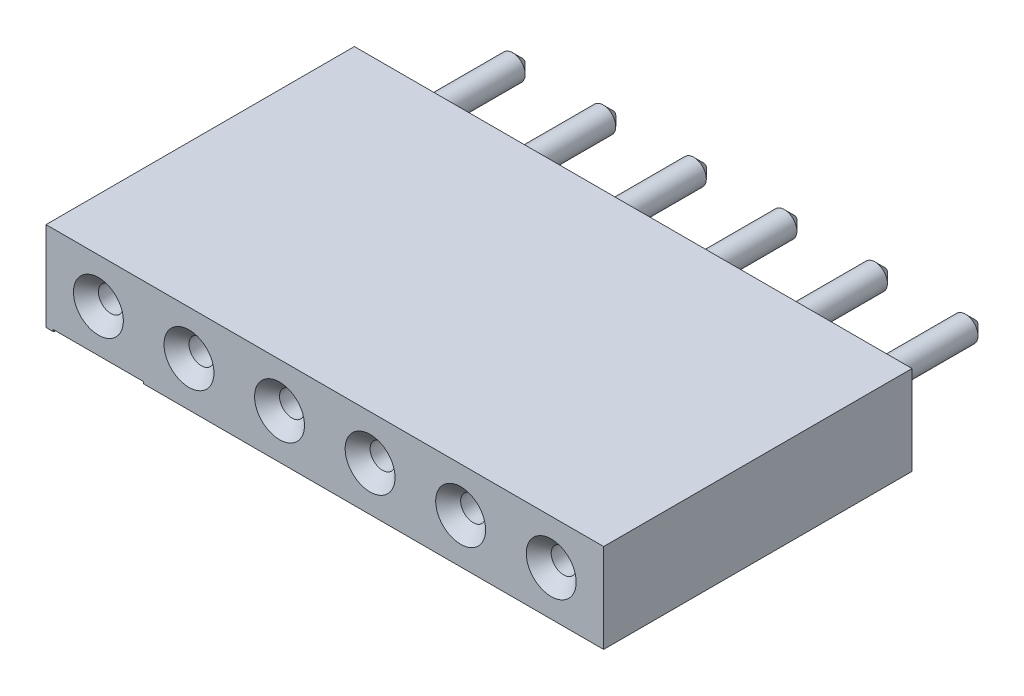
ISO-10303-21;
HEADER;
FILE_DESCRIPTION(('STEP AP214'),'2;1');
FILE_NAME('part.step','',(''),(''),'','','');
FILE_SCHEMA(('AUTOMOTIVE_DESIGN { 1 0 10303 214 1 1 1 1 }'));
ENDSEC;
DATA;
#1=APPLICATION_CONTEXT('core data for automotive mechanical design processes');
#2=APPLICATION_PROTOCOL_DEFINITION('international standard','automotive_design',2000,#1);
#3=PRODUCT_CONTEXT('',#1,'mechanical');
#4=PRODUCT('Part','Part','',(#3));
#5=PRODUCT_RELATED_PRODUCT_CATEGORY('part','',(#4));
#6=PRODUCT_DEFINITION_FORMATION('','',#4);
#7=PRODUCT_DEFINITION_CONTEXT('part definition',#1,'design');
#8=PRODUCT_DEFINITION('design','',#6,#7);
#9=PRODUCT_DEFINITION_SHAPE('','',#8);
#10=(LENGTH_UNIT() NAMED_UNIT(*) SI_UNIT(.MILLI.,.METRE.));
#11=(NAMED_UNIT(*) PLANE_ANGLE_UNIT() SI_UNIT($,.RADIAN.));
#12=(NAMED_UNIT(*) SI_UNIT($,.STERADIAN.) SOLID_ANGLE_UNIT());
#13=UNCERTAINTY_MEASURE_WITH_UNIT(LENGTH_MEASURE(1.E-05),#10,'distance_accuracy_value','');
#14=(GEOMETRIC_REPRESENTATION_CONTEXT(3) GLOBAL_UNCERTAINTY_ASSIGNED_CONTEXT((#13)) GLOBAL_UNIT_ASSIGNED_CONTEXT((#10,
#11,#12)) REPRESENTATION_CONTEXT('',''));
#15=CARTESIAN_POINT('',(0.,0.,0.));
#16=DIRECTION('',(0.,0.,1.));
#17=DIRECTION('',(1.,0.,0.));
#18=AXIS2_PLACEMENT_3D('',#15,#16,#17);
#19=CARTESIAN_POINT('',(12.7,0.,1.73));
#20=DIRECTION('',(0.,0.,1.));
#21=DIRECTION('',(1.,0.,0.));
#22=AXIS2_PLACEMENT_3D('',#19,#20,#21);
#23=PLANE('',#22);
#24=CARTESIAN_POINT('',(12.7,0.,1.73));
#25=DIRECTION('',(0.,0.,1.));
#26=DIRECTION('',(1.,0.,0.));
#27=AXIS2_PLACEMENT_3D('',#24,#25,#26);
#28=CIRCLE('',#27,0.35);
#29=CARTESIAN_POINT('',(13.05,0.,1.73));
#30=VERTEX_POINT('',#29);
#31=EDGE_CURVE('P0_E11',#30,#30,#28,.T.);
#32=ORIENTED_EDGE('',*,*,#31,.T.);
#33=EDGE_LOOP('',(#32));
#34=FACE_BOUND('',#33,.T.);
#35=ADVANCED_FACE('P0_F17',(#34),#23,.T.);
#36=CARTESIAN_POINT('',(10.16,0.,1.73));
#37=DIRECTION('',(0.,0.,1.));
#38=DIRECTION('',(1.,0.,0.));
#39=AXIS2_PLACEMENT_3D('',#36,#37,#38);
#40=PLANE('',#39);
#41=CARTESIAN_POINT('',(10.16,0.,1.73));
#42=DIRECTION('',(0.,0.,1.));
#43=DIRECTION('',(1.,0.,0.));
#44=AXIS2_PLACEMENT_3D('',#41,#42,#43);
#45=CIRCLE('',#44,0.35);
#46=CARTESIAN_POINT('',(10.51,0.,1.73));
#47=VERTEX_POINT('',#46);
#48=EDGE_CURVE('P0_E206',#47,#47,#45,.T.);
#49=ORIENTED_EDGE('',*,*,#48,.T.);
#50=EDGE_LOOP('',(#49));
#51=FACE_BOUND('',#50,.T.);
#52=ADVANCED_FACE('P0_F405',(#51),#40,.T.);
#53=CARTESIAN_POINT('',(5.08,0.,1.73));
#54=DIRECTION('',(0.,0.,1.));
#55=DIRECTION('',(1.,0.,0.));
#56=AXIS2_PLACEMENT_3D('',#53,#54,#55);
#57=PLANE('',#56);
#58=CARTESIAN_POINT('',(5.08,0.,1.73));
#59=DIRECTION('',(0.,0.,1.));
#60=DIRECTION('',(1.,0.,0.));
#61=AXIS2_PLACEMENT_3D('',#58,#59,#60);
#62=CIRCLE('',#61,0.35);
#63=CARTESIAN_POINT('',(5.43,0.,1.73));
#64=VERTEX_POINT('',#63);
#65=EDGE_CURVE('P0_E263',#64,#64,#62,.T.);
#66=ORIENTED_EDGE('',*,*,#65,.T.);
#67=EDGE_LOOP('',(#66));
#68=FACE_BOUND('',#67,.T.);
#69=ADVANCED_FACE('P0_F407',(#68),#57,.T.);
#70=CARTESIAN_POINT('',(7.62,0.,1.73));
#71=DIRECTION('',(0.,0.,1.));
#72=DIRECTION('',(1.,0.,0.));
#73=AXIS2_PLACEMENT_3D('',#70,#71,#72);
#74=PLANE('',#73);
#75=CARTESIAN_POINT('',(7.62,0.,1.73));
#76=DIRECTION('',(0.,0.,1.));
#77=DIRECTION('',(1.,0.,0.));
#78=AXIS2_PLACEMENT_3D('',#75,#76,#77);
#79=CIRCLE('',#78,0.35);
#80=CARTESIAN_POINT('',(7.97,0.,1.73));
#81=VERTEX_POINT('',#80);
#82=EDGE_CURVE('P0_E213',#81,#81,#79,.T.);
#83=ORIENTED_EDGE('',*,*,#82,.T.);
#84=EDGE_LOOP('',(#83));
#85=FACE_BOUND('',#84,.T.);
#86=ADVANCED_FACE('P0_F415',(#85),#74,.T.);
#87=CARTESIAN_POINT('',(2.54,0.,1.73));
#88=DIRECTION('',(0.,0.,1.));
#89=DIRECTION('',(1.,0.,0.));
#90=AXIS2_PLACEMENT_3D('',#87,#88,#89);
#91=PLANE('',#90);
#92=CARTESIAN_POINT('',(2.54,0.,1.73));
#93=DIRECTION('',(0.,0.,1.));
#94=DIRECTION('',(1.,0.,0.));
#95=AXIS2_PLACEMENT_3D('',#92,#93,#94);
#96=CIRCLE('',#95,0.35);
#97=CARTESIAN_POINT('',(2.89,0.,1.73));
#98=VERTEX_POINT('',#97);
#99=EDGE_CURVE('P0_E214',#98,#98,#96,.T.);
#100=ORIENTED_EDGE('',*,*,#99,.T.);
#101=EDGE_LOOP('',(#100));
#102=FACE_BOUND('',#101,.T.);
#103=ADVANCED_FACE('P0_F442',(#102),#91,.T.);
#104=CARTESIAN_POINT('',(0.,0.,1.73));
#105=DIRECTION('',(0.,0.,1.));
#106=DIRECTION('',(1.,0.,0.));
#107=AXIS2_PLACEMENT_3D('',#104,#105,#106);
#108=PLANE('',#107);
#109=CARTESIAN_POINT('',(0.,0.,1.73));
#110=DIRECTION('',(0.,0.,1.));
#111=DIRECTION('',(1.,0.,0.));
#112=AXIS2_PLACEMENT_3D('',#109,#110,#111);
#113=CIRCLE('',#112,0.35);
#114=CARTESIAN_POINT('',(0.35,0.,1.73));
#115=VERTEX_POINT('',#114);
#116=EDGE_CURVE('P0_E240',#115,#115,#113,.T.);
#117=ORIENTED_EDGE('',*,*,#116,.T.);
#118=EDGE_LOOP('',(#117));
#119=FACE_BOUND('',#118,.T.);
#120=ADVANCED_FACE('P0_F427',(#119),#108,.T.);
#121=CARTESIAN_POINT('',(12.7,0.,1.73));
#122=DIRECTION('',(0.,0.,1.));
#123=DIRECTION('',(1.,0.,0.));
#124=AXIS2_PLACEMENT_3D('',#121,#122,#123);
#125=CYLINDRICAL_SURFACE('',#124,0.35);
#126=DIRECTION('',(0.,0.,1.));
#127=VECTOR('',#126,1.);
#128=CARTESIAN_POINT('',(13.05,0.,1.73));
#129=LINE('',#128,#127);
#130=CARTESIAN_POINT('',(13.05,0.,8.3));
#131=VERTEX_POINT('',#130);
#132=EDGE_CURVE('P0_E28',#30,#131,#129,.T.);
#133=ORIENTED_EDGE('',*,*,#132,.F.);
#134=ORIENTED_EDGE('',*,*,#31,.F.);
#135=ORIENTED_EDGE('',*,*,#132,.T.);
#136=CARTESIAN_POINT('',(12.7,0.,8.3));
#137=DIRECTION('',(0.,0.,1.));
#138=DIRECTION('',(1.,0.,0.));
#139=AXIS2_PLACEMENT_3D('',#136,#137,#138);
#140=CIRCLE('',#139,0.35);
#141=EDGE_CURVE('P0_E184',#131,#131,#140,.T.);
#142=ORIENTED_EDGE('',*,*,#141,.T.);
#143=EDGE_LOOP('',(#133,#134,#135,#142));
#144=FACE_BOUND('',#143,.T.);
#145=ADVANCED_FACE('P0_F350',(#144),#125,.F.);
#146=CARTESIAN_POINT('',(10.16,0.,1.73));
#147=DIRECTION('',(0.,0.,1.));
#148=DIRECTION('',(1.,0.,0.));
#149=AXIS2_PLACEMENT_3D('',#146,#147,#148);
#150=CYLINDRICAL_SURFACE('',#149,0.35);
#151=DIRECTION('',(0.,0.,1.));
#152=VECTOR('',#151,1.);
#153=CARTESIAN_POINT('',(10.51,0.,1.73));
#154=LINE('',#153,#152);
#155=CARTESIAN_POINT('',(10.51,0.,8.3));
#156=VERTEX_POINT('',#155);
#157=EDGE_CURVE('P0_E209',#47,#156,#154,.T.);
#158=ORIENTED_EDGE('',*,*,#157,.F.);
#159=ORIENTED_EDGE('',*,*,#48,.F.);
#160=ORIENTED_EDGE('',*,*,#157,.T.);
#161=CARTESIAN_POINT('',(10.16,0.,8.3));
#162=DIRECTION('',(0.,0.,1.));
#163=DIRECTION('',(1.,0.,0.));
#164=AXIS2_PLACEMENT_3D('',#161,#162,#163);
#165=CIRCLE('',#164,0.35);
#166=EDGE_CURVE('P0_E279',#156,#156,#165,.T.);
#167=ORIENTED_EDGE('',*,*,#166,.T.);
#168=EDGE_LOOP('',(#158,#159,#160,#167));
#169=FACE_BOUND('',#168,.T.);
#170=ADVANCED_FACE('P0_F403',(#169),#150,.F.);
#171=CARTESIAN_POINT('',(5.08,0.,1.73));
#172=DIRECTION('',(0.,0.,1.));
#173=DIRECTION('',(1.,0.,0.));
#174=AXIS2_PLACEMENT_3D('',#171,#172,#173);
#175=CYLINDRICAL_SURFACE('',#174,0.35);
#176=DIRECTION('',(0.,0.,1.));
#177=VECTOR('',#176,1.);
#178=CARTESIAN_POINT('',(5.43,0.,1.73));
#179=LINE('',#178,#177);
#180=CARTESIAN_POINT('',(5.43,0.,8.3));
#181=VERTEX_POINT('',#180);
#182=EDGE_CURVE('P0_E260',#64,#181,#179,.T.);
#183=ORIENTED_EDGE('',*,*,#182,.F.);
#184=ORIENTED_EDGE('',*,*,#65,.F.);
#185=ORIENTED_EDGE('',*,*,#182,.T.);
#186=CARTESIAN_POINT('',(5.08,0.,8.3));
#187=DIRECTION('',(0.,0.,1.));
#188=DIRECTION('',(1.,0.,0.));
#189=AXIS2_PLACEMENT_3D('',#186,#187,#188);
#190=CIRCLE('',#189,0.35);
#191=EDGE_CURVE('P0_E328',#181,#181,#190,.T.);
#192=ORIENTED_EDGE('',*,*,#191,.T.);
#193=EDGE_LOOP('',(#183,#184,#185,#192));
#194=FACE_BOUND('',#193,.T.);
#195=ADVANCED_FACE('P0_F420',(#194),#175,.F.);
#196=CARTESIAN_POINT('',(7.62,0.,1.73));
#197=DIRECTION('',(0.,0.,1.));
#198=DIRECTION('',(1.,0.,0.));
#199=AXIS2_PLACEMENT_3D('',#196,#197,#198);
#200=CYLINDRICAL_SURFACE('',#199,0.35);
#201=DIRECTION('',(0.,0.,1.));
#202=VECTOR('',#201,1.);
#203=CARTESIAN_POINT('',(7.97,0.,1.73));
#204=LINE('',#203,#202);
#205=CARTESIAN_POINT('',(7.97,0.,8.3));
#206=VERTEX_POINT('',#205);
#207=EDGE_CURVE('P0_E210',#81,#206,#204,.T.);
#208=ORIENTED_EDGE('',*,*,#207,.F.);
#209=ORIENTED_EDGE('',*,*,#82,.F.);
#210=ORIENTED_EDGE('',*,*,#207,.T.);
#211=CARTESIAN_POINT('',(7.62,0.,8.3));
#212=DIRECTION('',(0.,0.,1.));
#213=DIRECTION('',(1.,0.,0.));
#214=AXIS2_PLACEMENT_3D('',#211,#212,#213);
#215=CIRCLE('',#214,0.35);
#216=EDGE_CURVE('P0_E167',#206,#206,#215,.T.);
#217=ORIENTED_EDGE('',*,*,#216,.T.);
#218=EDGE_LOOP('',(#208,#209,#210,#217));
#219=FACE_BOUND('',#218,.T.);
#220=ADVANCED_FACE('P0_F434',(#219),#200,.F.);
#221=CARTESIAN_POINT('',(2.54,0.,1.73));
#222=DIRECTION('',(0.,0.,1.));
#223=DIRECTION('',(1.,0.,0.));
#224=AXIS2_PLACEMENT_3D('',#221,#222,#223);
#225=CYLINDRICAL_SURFACE('',#224,0.35);
#226=DIRECTION('',(0.,0.,1.));
#227=VECTOR('',#226,1.);
#228=CARTESIAN_POINT('',(2.89,0.,1.73));
#229=LINE('',#228,#227);
#230=CARTESIAN_POINT('',(2.89,0.,8.3));
#231=VERTEX_POINT('',#230);
#232=EDGE_CURVE('P0_E252',#98,#231,#229,.T.);
#233=ORIENTED_EDGE('',*,*,#232,.F.);
#234=ORIENTED_EDGE('',*,*,#99,.F.);
#235=ORIENTED_EDGE('',*,*,#232,.T.);
#236=CARTESIAN_POINT('',(2.54,0.,8.3));
#237=DIRECTION('',(0.,0.,1.));
#238=DIRECTION('',(1.,0.,0.));
#239=AXIS2_PLACEMENT_3D('',#236,#237,#238);
#240=CIRCLE('',#239,0.35);
#241=EDGE_CURVE('P0_E169',#231,#231,#240,.T.);
#242=ORIENTED_EDGE('',*,*,#241,.T.);
#243=EDGE_LOOP('',(#233,#234,#235,#242));
#244=FACE_BOUND('',#243,.T.);
#245=ADVANCED_FACE('P0_F437',(#244),#225,.F.);
#246=CARTESIAN_POINT('',(0.,0.,1.73));
#247=DIRECTION('',(0.,0.,1.));
#248=DIRECTION('',(1.,0.,0.));
#249=AXIS2_PLACEMENT_3D('',#246,#247,#248);
#250=CYLINDRICAL_SURFACE('',#249,0.35);
#251=DIRECTION('',(0.,0.,1.));
#252=VECTOR('',#251,1.);
#253=CARTESIAN_POINT('',(0.35,0.,1.73));
#254=LINE('',#253,#252);
#255=CARTESIAN_POINT('',(0.35,0.,8.3));
#256=VERTEX_POINT('',#255);
#257=EDGE_CURVE('P0_E188',#115,#256,#254,.T.);
#258=ORIENTED_EDGE('',*,*,#257,.F.);
#259=ORIENTED_EDGE('',*,*,#116,.F.);
#260=ORIENTED_EDGE('',*,*,#257,.T.);
#261=CARTESIAN_POINT('',(0.,0.,8.3));
#262=DIRECTION('',(0.,0.,1.));
#263=DIRECTION('',(1.,0.,0.));
#264=AXIS2_PLACEMENT_3D('',#261,#262,#263);
#265=CIRCLE('',#264,0.35);
#266=EDGE_CURVE('P0_E255',#256,#256,#265,.T.);
#267=ORIENTED_EDGE('',*,*,#266,.T.);
#268=EDGE_LOOP('',(#258,#259,#260,#267));
#269=FACE_BOUND('',#268,.T.);
#270=ADVANCED_FACE('P0_F450',(#269),#250,.F.);
#271=CARTESIAN_POINT('',(12.7,0.,8.65));
#272=DIRECTION('',(0.,0.,1.));
#273=DIRECTION('',(1.,0.,0.));
#274=AXIS2_PLACEMENT_3D('',#271,#272,#273);
#275=CONICAL_SURFACE('',#274,0.7,0.785398163397);
#276=DIRECTION('',(-0.707106781186548,0.,-0.707106781186548));
#277=VECTOR('',#276,1.);
#278=CARTESIAN_POINT('',(13.4,0.,8.65));
#279=LINE('',#278,#277);
#280=CARTESIAN_POINT('',(13.4,0.,8.65));
#281=VERTEX_POINT('',#280);
#282=EDGE_CURVE('P0_E189',#281,#131,#279,.T.);
#283=ORIENTED_EDGE('',*,*,#282,.F.);
#284=CARTESIAN_POINT('',(12.7,0.,8.65));
#285=DIRECTION('',(0.,0.,1.));
#286=DIRECTION('',(1.,0.,0.));
#287=AXIS2_PLACEMENT_3D('',#284,#285,#286);
#288=CIRCLE('',#287,0.7);
#289=EDGE_CURVE('P0_E193',#281,#281,#288,.T.);
#290=ORIENTED_EDGE('',*,*,#289,.T.);
#291=ORIENTED_EDGE('',*,*,#282,.T.);
#292=ORIENTED_EDGE('',*,*,#141,.F.);
#293=EDGE_LOOP('',(#283,#290,#291,#292));
#294=FACE_BOUND('',#293,.T.);
#295=ADVANCED_FACE('P0_F353',(#294),#275,.F.);
#296=CARTESIAN_POINT('',(10.16,0.,8.65));
#297=DIRECTION('',(0.,0.,1.));
#298=DIRECTION('',(1.,0.,0.));
#299=AXIS2_PLACEMENT_3D('',#296,#297,#298);
#300=CONICAL_SURFACE('',#299,0.7,0.785398163397);
#301=DIRECTION('',(-0.707106781186548,0.,-0.707106781186548));
#302=VECTOR('',#301,1.);
#303=CARTESIAN_POINT('',(10.86,0.,8.65));
#304=LINE('',#303,#302);
#305=CARTESIAN_POINT('',(10.86,0.,8.65));
#306=VERTEX_POINT('',#305);
#307=EDGE_CURVE('P0_E318',#306,#156,#304,.T.);
#308=ORIENTED_EDGE('',*,*,#307,.F.);
#309=CARTESIAN_POINT('',(10.16,0.,8.65));
#310=DIRECTION('',(0.,0.,1.));
#311=DIRECTION('',(1.,0.,0.));
#312=AXIS2_PLACEMENT_3D('',#309,#310,#311);
#313=CIRCLE('',#312,0.7);
#314=EDGE_CURVE('P0_E190',#306,#306,#313,.T.);
#315=ORIENTED_EDGE('',*,*,#314,.T.);
#316=ORIENTED_EDGE('',*,*,#307,.T.);
#317=ORIENTED_EDGE('',*,*,#166,.F.);
#318=EDGE_LOOP('',(#308,#315,#316,#317));
#319=FACE_BOUND('',#318,.T.);
#320=ADVANCED_FACE('P0_F464',(#319),#300,.F.);
#321=CARTESIAN_POINT('',(5.08,0.,8.65));
#322=DIRECTION('',(0.,0.,1.));
#323=DIRECTION('',(1.,0.,0.));
#324=AXIS2_PLACEMENT_3D('',#321,#322,#323);
#325=CONICAL_SURFACE('',#324,0.7,0.785398163397);
#326=DIRECTION('',(-0.707106781186548,0.,-0.707106781186548));
#327=VECTOR('',#326,1.);
#328=CARTESIAN_POINT('',(5.78,0.,8.65));
#329=LINE('',#328,#327);
#330=CARTESIAN_POINT('',(5.78,0.,8.65));
#331=VERTEX_POINT('',#330);
#332=EDGE_CURVE('P0_E176',#331,#181,#329,.T.);
#333=ORIENTED_EDGE('',*,*,#332,.F.);
#334=CARTESIAN_POINT('',(5.08,0.,8.65));
#335=DIRECTION('',(0.,0.,1.));
#336=DIRECTION('',(1.,0.,0.));
#337=AXIS2_PLACEMENT_3D('',#334,#335,#336);
#338=CIRCLE('',#337,0.7);
#339=EDGE_CURVE('P0_E194',#331,#331,#338,.T.);
#340=ORIENTED_EDGE('',*,*,#339,.T.);
#341=ORIENTED_EDGE('',*,*,#332,.T.);
#342=ORIENTED_EDGE('',*,*,#191,.F.);
#343=EDGE_LOOP('',(#333,#340,#341,#342));
#344=FACE_BOUND('',#343,.T.);
#345=ADVANCED_FACE('P0_F469',(#344),#325,.F.);
#346=CARTESIAN_POINT('',(7.62,0.,8.65));
#347=DIRECTION('',(0.,0.,1.));
#348=DIRECTION('',(1.,0.,0.));
#349=AXIS2_PLACEMENT_3D('',#346,#347,#348);
#350=CONICAL_SURFACE('',#349,0.7,0.785398163397);
#351=DIRECTION('',(-0.707106781186548,0.,-0.707106781186548));
#352=VECTOR('',#351,1.);
#353=CARTESIAN_POINT('',(8.32,0.,8.65));
#354=LINE('',#353,#352);
#355=CARTESIAN_POINT('',(8.32,0.,8.65));
#356=VERTEX_POINT('',#355);
#357=EDGE_CURVE('P0_E162',#356,#206,#354,.T.);
#358=ORIENTED_EDGE('',*,*,#357,.F.);
#359=CARTESIAN_POINT('',(7.62,0.,8.65));
#360=DIRECTION('',(0.,0.,1.));
#361=DIRECTION('',(1.,0.,0.));
#362=AXIS2_PLACEMENT_3D('',#359,#360,#361);
#363=CIRCLE('',#362,0.7);
#364=EDGE_CURVE('P0_E165',#356,#356,#363,.T.);
#365=ORIENTED_EDGE('',*,*,#364,.T.);
#366=ORIENTED_EDGE('',*,*,#357,.T.);
#367=ORIENTED_EDGE('',*,*,#216,.F.);
#368=EDGE_LOOP('',(#358,#365,#366,#367));
#369=FACE_BOUND('',#368,.T.);
#370=ADVANCED_FACE('P0_F163',(#369),#350,.F.);
#371=CARTESIAN_POINT('',(2.54,0.,8.65));
#372=DIRECTION('',(0.,0.,1.));
#373=DIRECTION('',(1.,0.,0.));
#374=AXIS2_PLACEMENT_3D('',#371,#372,#373);
#375=CONICAL_SURFACE('',#374,0.7,0.785398163397);
#376=DIRECTION('',(-0.707106781186548,0.,-0.707106781186548));
#377=VECTOR('',#376,1.);
#378=CARTESIAN_POINT('',(3.24,0.,8.65));
#379=LINE('',#378,#377);
#380=CARTESIAN_POINT('',(3.24,0.,8.65));
#381=VERTEX_POINT('',#380);
#382=EDGE_CURVE('P0_E179',#381,#231,#379,.T.);
#383=ORIENTED_EDGE('',*,*,#382,.F.);
#384=CARTESIAN_POINT('',(2.54,0.,8.65));
#385=DIRECTION('',(0.,0.,1.));
#386=DIRECTION('',(1.,0.,0.));
#387=AXIS2_PLACEMENT_3D('',#384,#385,#386);
#388=CIRCLE('',#387,0.7);
#389=EDGE_CURVE('P0_E196',#381,#381,#388,.T.);
#390=ORIENTED_EDGE('',*,*,#389,.T.);
#391=ORIENTED_EDGE('',*,*,#382,.T.);
#392=ORIENTED_EDGE('',*,*,#241,.F.);
#393=EDGE_LOOP('',(#383,#390,#391,#392));
#394=FACE_BOUND('',#393,.T.);
#395=ADVANCED_FACE('P0_F422',(#394),#375,.F.);
#396=CARTESIAN_POINT('',(0.,0.,8.65));
#397=DIRECTION('',(0.,0.,1.));
#398=DIRECTION('',(1.,0.,0.));
#399=AXIS2_PLACEMENT_3D('',#396,#397,#398);
#400=CONICAL_SURFACE('',#399,0.7,0.785398163397);
#401=DIRECTION('',(-0.707106781186548,0.,-0.707106781186548));
#402=VECTOR('',#401,1.);
#403=CARTESIAN_POINT('',(0.7,0.,8.65));
#404=LINE('',#403,#402);
#405=CARTESIAN_POINT('',(0.7,0.,8.65));
#406=VERTEX_POINT('',#405);
#407=EDGE_CURVE('P0_E259',#406,#256,#404,.T.);
#408=ORIENTED_EDGE('',*,*,#407,.F.);
#409=CARTESIAN_POINT('',(0.,0.,8.65));
#410=DIRECTION('',(0.,0.,1.));
#411=DIRECTION('',(1.,0.,0.));
#412=AXIS2_PLACEMENT_3D('',#409,#410,#411);
#413=CIRCLE('',#412,0.7);
#414=EDGE_CURVE('P0_E200',#406,#406,#413,.T.);
#415=ORIENTED_EDGE('',*,*,#414,.T.);
#416=ORIENTED_EDGE('',*,*,#407,.T.);
#417=ORIENTED_EDGE('',*,*,#266,.F.);
#418=EDGE_LOOP('',(#408,#415,#416,#417));
#419=FACE_BOUND('',#418,.T.);
#420=ADVANCED_FACE('P0_F19',(#419),#400,.F.);
#421=CARTESIAN_POINT('',(0.,-1.196428571429,7.772451582856));
#422=DIRECTION('',(0.,1.,0.));
#423=DIRECTION('',(0.,0.,-1.));
#424=AXIS2_PLACEMENT_3D('',#421,#422,#423);
#425=PLANE('',#424);
#426=DIRECTION('',(0.447213595499958,0.,-0.894427190999916));
#427=VECTOR('',#426,1.);
#428=CARTESIAN_POINT('',(-1.27,-1.196428571429,8.65));
#429=LINE('',#428,#427);
#430=CARTESIAN_POINT('',(-1.27,-1.196428571429,8.65));
#431=VERTEX_POINT('',#430);
#432=CARTESIAN_POINT('',(0.,-1.196428571429,6.11));
#433=VERTEX_POINT('',#432);
#434=EDGE_CURVE('P0_E303',#431,#433,#429,.T.);
#435=ORIENTED_EDGE('',*,*,#434,.T.);
#436=DIRECTION('',(-0.447213595499958,0.,-0.894427190999916));
#437=VECTOR('',#436,1.);
#438=CARTESIAN_POINT('',(1.27,-1.196428571429,8.65));
#439=LINE('',#438,#437);
#440=CARTESIAN_POINT('',(1.27,-1.196428571429,8.65));
#441=VERTEX_POINT('',#440);
#442=EDGE_CURVE('P0_E236',#441,#433,#439,.T.);
#443=ORIENTED_EDGE('',*,*,#442,.F.);
#444=DIRECTION('',(1.,0.,0.));
#445=VECTOR('',#444,1.);
#446=CARTESIAN_POINT('',(-1.27,-1.196428571429,8.65));
#447=LINE('',#446,#445);
#448=EDGE_CURVE('P0_E290',#431,#441,#447,.T.);
#449=ORIENTED_EDGE('',*,*,#448,.F.);
#450=EDGE_LOOP('',(#435,#443,#449));
#451=FACE_BOUND('',#450,.T.);
#452=ADVANCED_FACE('P0_F390',(#451),#425,.F.);
#453=CARTESIAN_POINT('',(-1.27,-1.25,8.65));
#454=DIRECTION('',(-0.894427190999916,0.,-0.447213595499958));
#455=DIRECTION('',(-0.447213595499958,0.,0.894427190999916));
#456=AXIS2_PLACEMENT_3D('',#453,#454,#455);
#457=PLANE('',#456);
#458=DIRECTION('',(0.447213595499958,0.,-0.894427190999916));
#459=VECTOR('',#458,1.);
#460=CARTESIAN_POINT('',(-1.27,-1.25,8.65));
#461=LINE('',#460,#459);
#462=CARTESIAN_POINT('',(-1.27,-1.25,8.65));
#463=VERTEX_POINT('',#462);
#464=CARTESIAN_POINT('',(0.,-1.25,6.11));
#465=VERTEX_POINT('',#464);
#466=EDGE_CURVE('P0_E227',#463,#465,#461,.T.);
#467=ORIENTED_EDGE('',*,*,#466,.T.);
#468=DIRECTION('',(0.,1.,0.));
#469=VECTOR('',#468,1.);
#470=CARTESIAN_POINT('',(0.,-1.25,6.11));
#471=LINE('',#470,#469);
#472=EDGE_CURVE('P0_E21',#465,#433,#471,.T.);
#473=ORIENTED_EDGE('',*,*,#472,.T.);
#474=ORIENTED_EDGE('',*,*,#434,.F.);
#475=DIRECTION('',(0.,1.,0.));
#476=VECTOR('',#475,1.);
#477=CARTESIAN_POINT('',(-1.27,-1.25,8.65));
#478=LINE('',#477,#476);
#479=EDGE_CURVE('P0_E219',#463,#431,#478,.T.);
#480=ORIENTED_EDGE('',*,*,#479,.F.);
#481=EDGE_LOOP('',(#467,#473,#474,#480));
#482=FACE_BOUND('',#481,.T.);
#483=ADVANCED_FACE('P0_F387',(#482),#457,.F.);
#484=CARTESIAN_POINT('',(1.27,-1.25,8.65));
#485=DIRECTION('',(-0.894427190999916,0.,0.447213595499958));
#486=DIRECTION('',(0.,1.,0.));
#487=AXIS2_PLACEMENT_3D('',#484,#485,#486);
#488=PLANE('',#487);
#489=DIRECTION('',(0.,1.,0.));
#490=VECTOR('',#489,1.);
#491=CARTESIAN_POINT('',(1.27,-1.25,8.65));
#492=LINE('',#491,#490);
#493=CARTESIAN_POINT('',(1.27,-1.25,8.65));
#494=VERTEX_POINT('',#493);
#495=EDGE_CURVE('P0_E205',#494,#441,#492,.T.);
#496=ORIENTED_EDGE('',*,*,#495,.T.);
#497=ORIENTED_EDGE('',*,*,#442,.T.);
#498=ORIENTED_EDGE('',*,*,#472,.F.);
#499=DIRECTION('',(-0.447213595499958,0.,-0.894427190999916));
#500=VECTOR('',#499,1.);
#501=CARTESIAN_POINT('',(1.27,-1.25,8.65));
#502=LINE('',#501,#500);
#503=EDGE_CURVE('P0_E232',#494,#465,#502,.T.);
#504=ORIENTED_EDGE('',*,*,#503,.F.);
#505=EDGE_LOOP('',(#496,#497,#498,#504));
#506=FACE_BOUND('',#505,.T.);
#507=ADVANCED_FACE('P0_F441',(#506),#488,.T.);
#508=CARTESIAN_POINT('',(14.17,-1.25,0.));
#509=DIRECTION('',(1.,0.,0.));
#510=DIRECTION('',(0.,1.,0.));
#511=AXIS2_PLACEMENT_3D('',#508,#509,#510);
#512=PLANE('',#511);
#513=DIRECTION('',(0.,0.,1.));
#514=VECTOR('',#513,1.);
#515=CARTESIAN_POINT('',(14.17,-1.25,0.));
#516=LINE('',#515,#514);
#517=CARTESIAN_POINT('',(14.17,-1.25,0.));
#518=VERTEX_POINT('',#517);
#519=CARTESIAN_POINT('',(14.17,-1.25,8.65));
#520=VERTEX_POINT('',#519);
#521=EDGE_CURVE('P0_E220',#518,#520,#516,.T.);
#522=ORIENTED_EDGE('',*,*,#521,.F.);
#523=DIRECTION('',(0.,1.,0.));
#524=VECTOR('',#523,1.);
#525=CARTESIAN_POINT('',(14.17,-1.25,0.));
#526=LINE('',#525,#524);
#527=CARTESIAN_POINT('',(14.17,1.25,0.));
#528=VERTEX_POINT('',#527);
#529=EDGE_CURVE('P0_E233',#518,#528,#526,.T.);
#530=ORIENTED_EDGE('',*,*,#529,.T.);
#531=DIRECTION('',(0.,0.,1.));
#532=VECTOR('',#531,1.);
#533=CARTESIAN_POINT('',(14.17,1.25,0.));
#534=LINE('',#533,#532);
#535=CARTESIAN_POINT('',(14.17,1.25,8.65));
#536=VERTEX_POINT('',#535);
#537=EDGE_CURVE('P0_E237',#528,#536,#534,.T.);
#538=ORIENTED_EDGE('',*,*,#537,.T.);
#539=DIRECTION('',(0.,1.,0.));
#540=VECTOR('',#539,1.);
#541=CARTESIAN_POINT('',(14.17,-1.25,8.65));
#542=LINE('',#541,#540);
#543=EDGE_CURVE('P0_E201',#520,#536,#542,.T.);
#544=ORIENTED_EDGE('',*,*,#543,.F.);
#545=EDGE_LOOP('',(#522,#530,#538,#544));
#546=FACE_BOUND('',#545,.T.);
#547=ADVANCED_FACE('P0_F432',(#546),#512,.T.);
#548=CARTESIAN_POINT('',(-1.47,-1.25,0.));
#549=DIRECTION('',(0.,0.,1.));
#550=DIRECTION('',(1.,0.,0.));
#551=AXIS2_PLACEMENT_3D('',#548,#549,#550);
#552=PLANE('',#551);
#553=DIRECTION('',(1.,0.,0.));
#554=VECTOR('',#553,1.);
#555=CARTESIAN_POINT('',(-1.47,1.25,0.));
#556=LINE('',#555,#554);
#557=CARTESIAN_POINT('',(-1.47,1.25,0.));
#558=VERTEX_POINT('',#557);
#559=EDGE_CURVE('P0_E271',#558,#528,#556,.T.);
#560=ORIENTED_EDGE('',*,*,#559,.T.);
#561=ORIENTED_EDGE('',*,*,#529,.F.);
#562=DIRECTION('',(1.,0.,0.));
#563=VECTOR('',#562,1.);
#564=CARTESIAN_POINT('',(-1.47,-1.25,0.));
#565=LINE('',#564,#563);
#566=CARTESIAN_POINT('',(-1.47,-1.25,0.));
#567=VERTEX_POINT('',#566);
#568=EDGE_CURVE('P0_E282',#567,#518,#565,.T.);
#569=ORIENTED_EDGE('',*,*,#568,.F.);
#570=DIRECTION('',(0.,1.,0.));
#571=VECTOR('',#570,1.);
#572=CARTESIAN_POINT('',(-1.47,-1.25,0.));
#573=LINE('',#572,#571);
#574=EDGE_CURVE('P0_E225',#567,#558,#573,.T.);
#575=ORIENTED_EDGE('',*,*,#574,.T.);
#576=EDGE_LOOP('',(#560,#561,#569,#575));
#577=FACE_BOUND('',#576,.T.);
#578=ADVANCED_FACE('P0_F429',(#577),#552,.F.);
#579=CARTESIAN_POINT('',(-1.47,1.25,0.));
#580=DIRECTION('',(0.,1.,0.));
#581=DIRECTION('',(1.,0.,0.));
#582=AXIS2_PLACEMENT_3D('',#579,#580,#581);
#583=PLANE('',#582);
#584=ORIENTED_EDGE('',*,*,#559,.F.);
#585=DIRECTION('',(0.,0.,1.));
#586=VECTOR('',#585,1.);
#587=CARTESIAN_POINT('',(-1.47,1.25,0.));
#588=LINE('',#587,#586);
#589=CARTESIAN_POINT('',(-1.47,1.25,8.65));
#590=VERTEX_POINT('',#589);
#591=EDGE_CURVE('P0_E221',#558,#590,#588,.T.);
#592=ORIENTED_EDGE('',*,*,#591,.T.);
#593=DIRECTION('',(1.,0.,0.));
#594=VECTOR('',#593,1.);
#595=CARTESIAN_POINT('',(-1.47,1.25,8.65));
#596=LINE('',#595,#594);
#597=EDGE_CURVE('P0_E215',#590,#536,#596,.T.);
#598=ORIENTED_EDGE('',*,*,#597,.T.);
#599=ORIENTED_EDGE('',*,*,#537,.F.);
#600=EDGE_LOOP('',(#584,#592,#598,#599));
#601=FACE_BOUND('',#600,.T.);
#602=ADVANCED_FACE('P0_F360',(#601),#583,.T.);
#603=CARTESIAN_POINT('',(-1.47,-1.25,8.65));
#604=DIRECTION('',(0.,0.,1.));
#605=DIRECTION('',(1.,0.,0.));
#606=AXIS2_PLACEMENT_3D('',#603,#604,#605);
#607=PLANE('',#606);
#608=ORIENTED_EDGE('',*,*,#289,.F.);
#609=EDGE_LOOP('',(#608));
#610=FACE_BOUND('',#609,.T.);
#611=ORIENTED_EDGE('',*,*,#314,.F.);
#612=EDGE_LOOP('',(#611));
#613=FACE_BOUND('',#612,.T.);
#614=ORIENTED_EDGE('',*,*,#339,.F.);
#615=EDGE_LOOP('',(#614));
#616=FACE_BOUND('',#615,.T.);
#617=ORIENTED_EDGE('',*,*,#364,.F.);
#618=EDGE_LOOP('',(#617));
#619=FACE_BOUND('',#618,.T.);
#620=ORIENTED_EDGE('',*,*,#389,.F.);
#621=EDGE_LOOP('',(#620));
#622=FACE_BOUND('',#621,.T.);
#623=ORIENTED_EDGE('',*,*,#414,.F.);
#624=EDGE_LOOP('',(#623));
#625=FACE_BOUND('',#624,.T.);
#626=ORIENTED_EDGE('',*,*,#597,.F.);
#627=DIRECTION('',(0.,1.,0.));
#628=VECTOR('',#627,1.);
#629=CARTESIAN_POINT('',(-1.47,-1.25,8.65));
#630=LINE('',#629,#628);
#631=CARTESIAN_POINT('',(-1.47,-1.25,8.65));
#632=VERTEX_POINT('',#631);
#633=EDGE_CURVE('P0_E226',#632,#590,#630,.T.);
#634=ORIENTED_EDGE('',*,*,#633,.F.);
#635=DIRECTION('',(1.,0.,0.));
#636=VECTOR('',#635,1.);
#637=CARTESIAN_POINT('',(-1.47,-1.25,8.65));
#638=LINE('',#637,#636);
#639=EDGE_CURVE('P0_E231',#632,#463,#638,.T.);
#640=ORIENTED_EDGE('',*,*,#639,.T.);
#641=ORIENTED_EDGE('',*,*,#479,.T.);
#642=ORIENTED_EDGE('',*,*,#448,.T.);
#643=ORIENTED_EDGE('',*,*,#495,.F.);
#644=DIRECTION('',(1.,0.,0.));
#645=VECTOR('',#644,1.);
#646=CARTESIAN_POINT('',(-1.47,-1.25,8.65));
#647=LINE('',#646,#645);
#648=EDGE_CURVE('P0_E241',#494,#520,#647,.T.);
#649=ORIENTED_EDGE('',*,*,#648,.T.);
#650=ORIENTED_EDGE('',*,*,#543,.T.);
#651=EDGE_LOOP('',(#626,#634,#640,#641,#642,#643,#649,#650));
#652=FACE_BOUND('',#651,.T.);
#653=ADVANCED_FACE('P0_F356',(#610,#613,#616,#619,#622,#625,#652),#607,.T.);
#654=CARTESIAN_POINT('',(-1.47,-1.25,0.));
#655=DIRECTION('',(0.,1.,0.));
#656=DIRECTION('',(1.,0.,0.));
#657=AXIS2_PLACEMENT_3D('',#654,#655,#656);
#658=PLANE('',#657);
#659=ORIENTED_EDGE('',*,*,#648,.F.);
#660=ORIENTED_EDGE('',*,*,#503,.T.);
#661=ORIENTED_EDGE('',*,*,#466,.F.);
#662=ORIENTED_EDGE('',*,*,#639,.F.);
#663=DIRECTION('',(0.,0.,1.));
#664=VECTOR('',#663,1.);
#665=CARTESIAN_POINT('',(-1.47,-1.25,0.));
#666=LINE('',#665,#664);
#667=EDGE_CURVE('P0_E245',#567,#632,#666,.T.);
#668=ORIENTED_EDGE('',*,*,#667,.F.);
#669=ORIENTED_EDGE('',*,*,#568,.T.);
#670=ORIENTED_EDGE('',*,*,#521,.T.);
#671=EDGE_LOOP('',(#659,#660,#661,#662,#668,#669,#670));
#672=FACE_BOUND('',#671,.T.);
#673=ADVANCED_FACE('P0_F359',(#672),#658,.F.);
#674=CARTESIAN_POINT('',(-1.47,-1.25,0.));
#675=DIRECTION('',(1.,0.,0.));
#676=DIRECTION('',(0.,1.,0.));
#677=AXIS2_PLACEMENT_3D('',#674,#675,#676);
#678=PLANE('',#677);
#679=ORIENTED_EDGE('',*,*,#633,.T.);
#680=ORIENTED_EDGE('',*,*,#591,.F.);
#681=ORIENTED_EDGE('',*,*,#574,.F.);
#682=ORIENTED_EDGE('',*,*,#667,.T.);
#683=EDGE_LOOP('',(#679,#680,#681,#682));
#684=FACE_BOUND('',#683,.T.);
#685=ADVANCED_FACE('P0_F379',(#684),#678,.F.);
#686=CLOSED_SHELL('',(#35,#52,#69,#86,#103,#120,#145,#170,#195,#220,#245,#270,#295,#320,#345,
#370,#395,#420,#452,#483,#507,#547,#578,#602,#653,#673,#685));
#687=MANIFOLD_SOLID_BREP('P0_B1',#686);
#688=CARTESIAN_POINT('',(0.,0.,-3.25));
#689=DIRECTION('',(0.,0.,1.));
#690=DIRECTION('',(1.,0.,0.));
#691=AXIS2_PLACEMENT_3D('',#688,#689,#690);
#692=PLANE('',#691);
#693=CARTESIAN_POINT('',(0.,0.,-3.25));
#694=DIRECTION('',(0.,0.,1.));
#695=DIRECTION('',(1.,0.,0.));
#696=AXIS2_PLACEMENT_3D('',#693,#694,#695);
#697=CIRCLE('',#696,0.07);
#698=CARTESIAN_POINT('',(0.07,0.,-3.25));
#699=VERTEX_POINT('',#698);
#700=EDGE_CURVE('P1_E28',#699,#699,#697,.T.);
#701=ORIENTED_EDGE('',*,*,#700,.F.);
#702=EDGE_LOOP('',(#701));
#703=FACE_BOUND('',#702,.T.);
#704=ADVANCED_FACE('P1_F17',(#703),#692,.F.);
#705=CARTESIAN_POINT('',(0.,0.,1.73));
#706=DIRECTION('',(0.,0.,1.));
#707=DIRECTION('',(1.,0.,0.));
#708=AXIS2_PLACEMENT_3D('',#705,#706,#707);
#709=PLANE('',#708);
#710=CARTESIAN_POINT('',(0.,0.,1.73));
#711=DIRECTION('',(0.,0.,1.));
#712=DIRECTION('',(1.,0.,0.));
#713=AXIS2_PLACEMENT_3D('',#710,#711,#712);
#714=CIRCLE('',#713,0.35);
#715=CARTESIAN_POINT('',(0.35,0.,1.73));
#716=VERTEX_POINT('',#715);
#717=EDGE_CURVE('P1_E45',#716,#716,#714,.T.);
#718=ORIENTED_EDGE('',*,*,#717,.T.);
#719=EDGE_LOOP('',(#718));
#720=FACE_BOUND('',#719,.T.);
#721=ADVANCED_FACE('P1_F19',(#720),#709,.T.);
#722=CARTESIAN_POINT('',(0.,0.,-2.97));
#723=DIRECTION('',(0.,0.,1.));
#724=DIRECTION('',(1.,0.,0.));
#725=AXIS2_PLACEMENT_3D('',#722,#723,#724);
#726=CONICAL_SURFACE('',#725,0.35,0.785398163397);
#727=ORIENTED_EDGE('',*,*,#700,.T.);
#728=DIRECTION('',(-0.707106781186548,0.,-0.707106781186548));
#729=VECTOR('',#728,1.);
#730=CARTESIAN_POINT('',(0.35,0.,-2.97));
#731=LINE('',#730,#729);
#732=CARTESIAN_POINT('',(0.35,0.,-2.97));
#733=VERTEX_POINT('',#732);
#734=EDGE_CURVE('P1_E11',#733,#699,#731,.T.);
#735=ORIENTED_EDGE('',*,*,#734,.F.);
#736=CARTESIAN_POINT('',(0.,0.,-2.97));
#737=DIRECTION('',(0.,0.,1.));
#738=DIRECTION('',(1.,0.,0.));
#739=AXIS2_PLACEMENT_3D('',#736,#737,#738);
#740=CIRCLE('',#739,0.35);
#741=EDGE_CURVE('P1_E21',#733,#733,#740,.T.);
#742=ORIENTED_EDGE('',*,*,#741,.F.);
#743=ORIENTED_EDGE('',*,*,#734,.T.);
#744=EDGE_LOOP('',(#727,#735,#742,#743));
#745=FACE_BOUND('',#744,.T.);
#746=ADVANCED_FACE('P1_F49',(#745),#726,.T.);
#747=CARTESIAN_POINT('',(0.,0.,-3.25));
#748=DIRECTION('',(0.,0.,1.));
#749=DIRECTION('',(1.,0.,0.));
#750=AXIS2_PLACEMENT_3D('',#747,#748,#749);
#751=CYLINDRICAL_SURFACE('',#750,0.35);
#752=DIRECTION('',(0.,0.,1.));
#753=VECTOR('',#752,1.);
#754=CARTESIAN_POINT('',(0.35,0.,-3.25));
#755=LINE('',#754,#753);
#756=EDGE_CURVE('P1_E55',#733,#716,#755,.T.);
#757=ORIENTED_EDGE('',*,*,#756,.T.);
#758=ORIENTED_EDGE('',*,*,#717,.F.);
#759=ORIENTED_EDGE('',*,*,#756,.F.);
#760=ORIENTED_EDGE('',*,*,#741,.T.);
#761=EDGE_LOOP('',(#757,#758,#759,#760));
#762=FACE_BOUND('',#761,.T.);
#763=ADVANCED_FACE('P1_F54',(#762),#751,.T.);
#764=CLOSED_SHELL('',(#704,#721,#746,#763));
#765=MANIFOLD_SOLID_BREP('P1_B1',#764);
#766=CARTESIAN_POINT('',(2.54,0.,-3.25));
#767=DIRECTION('',(0.,0.,1.));
#768=DIRECTION('',(1.,0.,0.));
#769=AXIS2_PLACEMENT_3D('',#766,#767,#768);
#770=PLANE('',#769);
#771=CARTESIAN_POINT('',(2.54,0.,-3.25));
#772=DIRECTION('',(0.,0.,1.));
#773=DIRECTION('',(1.,0.,0.));
#774=AXIS2_PLACEMENT_3D('',#771,#772,#773);
#775=CIRCLE('',#774,0.07);
#776=CARTESIAN_POINT('',(2.61,0.,-3.25));
#777=VERTEX_POINT('',#776);
#778=EDGE_CURVE('P2_E26',#777,#777,#775,.T.);
#779=ORIENTED_EDGE('',*,*,#778,.F.);
#780=EDGE_LOOP('',(#779));
#781=FACE_BOUND('',#780,.T.);
#782=ADVANCED_FACE('P2_F17',(#781),#770,.F.);
#783=CARTESIAN_POINT('',(2.54,0.,1.73));
#784=DIRECTION('',(0.,0.,1.));
#785=DIRECTION('',(1.,0.,0.));
#786=AXIS2_PLACEMENT_3D('',#783,#784,#785);
#787=PLANE('',#786);
#788=CARTESIAN_POINT('',(2.54,0.,1.73));
#789=DIRECTION('',(0.,0.,1.));
#790=DIRECTION('',(1.,0.,0.));
#791=AXIS2_PLACEMENT_3D('',#788,#789,#790);
#792=CIRCLE('',#791,0.35);
#793=CARTESIAN_POINT('',(2.89,0.,1.73));
#794=VERTEX_POINT('',#793);
#795=EDGE_CURVE('P2_E43',#794,#794,#792,.T.);
#796=ORIENTED_EDGE('',*,*,#795,.T.);
#797=EDGE_LOOP('',(#796));
#798=FACE_BOUND('',#797,.T.);
#799=ADVANCED_FACE('P2_F19',(#798),#787,.T.);
#800=CARTESIAN_POINT('',(2.54,0.,-2.97));
#801=DIRECTION('',(0.,0.,1.));
#802=DIRECTION('',(1.,0.,0.));
#803=AXIS2_PLACEMENT_3D('',#800,#801,#802);
#804=CONICAL_SURFACE('',#803,0.35,0.785398163397);
#805=ORIENTED_EDGE('',*,*,#778,.T.);
#806=DIRECTION('',(-0.707106781186548,0.,-0.707106781186548));
#807=VECTOR('',#806,1.);
#808=CARTESIAN_POINT('',(2.89,0.,-2.97));
#809=LINE('',#808,#807);
#810=CARTESIAN_POINT('',(2.89,0.,-2.97));
#811=VERTEX_POINT('',#810);
#812=EDGE_CURVE('P2_E11',#811,#777,#809,.T.);
#813=ORIENTED_EDGE('',*,*,#812,.F.);
#814=CARTESIAN_POINT('',(2.54,0.,-2.97));
#815=DIRECTION('',(0.,0.,1.));
#816=DIRECTION('',(1.,0.,0.));
#817=AXIS2_PLACEMENT_3D('',#814,#815,#816);
#818=CIRCLE('',#817,0.35);
#819=EDGE_CURVE('P2_E49',#811,#811,#818,.T.);
#820=ORIENTED_EDGE('',*,*,#819,.F.);
#821=ORIENTED_EDGE('',*,*,#812,.T.);
#822=EDGE_LOOP('',(#805,#813,#820,#821));
#823=FACE_BOUND('',#822,.T.);
#824=ADVANCED_FACE('P2_F48',(#823),#804,.T.);
#825=CARTESIAN_POINT('',(2.54,0.,-3.25));
#826=DIRECTION('',(0.,0.,1.));
#827=DIRECTION('',(1.,0.,0.));
#828=AXIS2_PLACEMENT_3D('',#825,#826,#827);
#829=CYLINDRICAL_SURFACE('',#828,0.35);
#830=DIRECTION('',(0.,0.,1.));
#831=VECTOR('',#830,1.);
#832=CARTESIAN_POINT('',(2.89,0.,-3.25));
#833=LINE('',#832,#831);
#834=EDGE_CURVE('P2_E55',#811,#794,#833,.T.);
#835=ORIENTED_EDGE('',*,*,#834,.T.);
#836=ORIENTED_EDGE('',*,*,#795,.F.);
#837=ORIENTED_EDGE('',*,*,#834,.F.);
#838=ORIENTED_EDGE('',*,*,#819,.T.);
#839=EDGE_LOOP('',(#835,#836,#837,#838));
#840=FACE_BOUND('',#839,.T.);
#841=ADVANCED_FACE('P2_F54',(#840),#829,.T.);
#842=CLOSED_SHELL('',(#782,#799,#824,#841));
#843=MANIFOLD_SOLID_BREP('P2_B1',#842);
#844=CARTESIAN_POINT('',(5.08,0.,-3.25));
#845=DIRECTION('',(0.,0.,1.));
#846=DIRECTION('',(1.,0.,0.));
#847=AXIS2_PLACEMENT_3D('',#844,#845,#846);
#848=PLANE('',#847);
#849=CARTESIAN_POINT('',(5.08,0.,-3.25));
#850=DIRECTION('',(0.,0.,1.));
#851=DIRECTION('',(1.,0.,0.));
#852=AXIS2_PLACEMENT_3D('',#849,#850,#851);
#853=CIRCLE('',#852,0.07);
#854=CARTESIAN_POINT('',(5.15,0.,-3.25));
#855=VERTEX_POINT('',#854);
#856=EDGE_CURVE('P3_E27',#855,#855,#853,.T.);
#857=ORIENTED_EDGE('',*,*,#856,.F.);
#858=EDGE_LOOP('',(#857));
#859=FACE_BOUND('',#858,.T.);
#860=ADVANCED_FACE('P3_F17',(#859),#848,.F.);
#861=CARTESIAN_POINT('',(5.08,0.,1.73));
#862=DIRECTION('',(0.,0.,1.));
#863=DIRECTION('',(1.,0.,0.));
#864=AXIS2_PLACEMENT_3D('',#861,#862,#863);
#865=PLANE('',#864);
#866=CARTESIAN_POINT('',(5.08,0.,1.73));
#867=DIRECTION('',(0.,0.,1.));
#868=DIRECTION('',(1.,0.,0.));
#869=AXIS2_PLACEMENT_3D('',#866,#867,#868);
#870=CIRCLE('',#869,0.35);
#871=CARTESIAN_POINT('',(5.43,0.,1.73));
#872=VERTEX_POINT('',#871);
#873=EDGE_CURVE('P3_E21',#872,#872,#870,.T.);
#874=ORIENTED_EDGE('',*,*,#873,.T.);
#875=EDGE_LOOP('',(#874));
#876=FACE_BOUND('',#875,.T.);
#877=ADVANCED_FACE('P3_F82',(#876),#865,.T.);
#878=CARTESIAN_POINT('',(5.08,0.,-2.97));
#879=DIRECTION('',(0.,0.,1.));
#880=DIRECTION('',(1.,0.,0.));
#881=AXIS2_PLACEMENT_3D('',#878,#879,#880);
#882=CONICAL_SURFACE('',#881,0.35,0.785398163397);
#883=ORIENTED_EDGE('',*,*,#856,.T.);
#884=DIRECTION('',(-0.707106781186548,0.,-0.707106781186548));
#885=VECTOR('',#884,1.);
#886=CARTESIAN_POINT('',(5.43,0.,-2.97));
#887=LINE('',#886,#885);
#888=CARTESIAN_POINT('',(5.43,0.,-2.97));
#889=VERTEX_POINT('',#888);
#890=EDGE_CURVE('P3_E11',#889,#855,#887,.T.);
#891=ORIENTED_EDGE('',*,*,#890,.F.);
#892=CARTESIAN_POINT('',(5.08,0.,-2.97));
#893=DIRECTION('',(0.,0.,1.));
#894=DIRECTION('',(1.,0.,0.));
#895=AXIS2_PLACEMENT_3D('',#892,#893,#894);
#896=CIRCLE('',#895,0.35);
#897=EDGE_CURVE('P3_E50',#889,#889,#896,.T.);
#898=ORIENTED_EDGE('',*,*,#897,.F.);
#899=ORIENTED_EDGE('',*,*,#890,.T.);
#900=EDGE_LOOP('',(#883,#891,#898,#899));
#901=FACE_BOUND('',#900,.T.);
#902=ADVANCED_FACE('P3_F49',(#901),#882,.T.);
#903=CARTESIAN_POINT('',(5.08,0.,-3.25));
#904=DIRECTION('',(0.,0.,1.));
#905=DIRECTION('',(1.,0.,0.));
#906=AXIS2_PLACEMENT_3D('',#903,#904,#905);
#907=CYLINDRICAL_SURFACE('',#906,0.35);
#908=DIRECTION('',(0.,0.,1.));
#909=VECTOR('',#908,1.);
#910=CARTESIAN_POINT('',(5.43,0.,-3.25));
#911=LINE('',#910,#909);
#912=EDGE_CURVE('P3_E55',#889,#872,#911,.T.);
#913=ORIENTED_EDGE('',*,*,#912,.T.);
#914=ORIENTED_EDGE('',*,*,#873,.F.);
#915=ORIENTED_EDGE('',*,*,#912,.F.);
#916=ORIENTED_EDGE('',*,*,#897,.T.);
#917=EDGE_LOOP('',(#913,#914,#915,#916));
#918=FACE_BOUND('',#917,.T.);
#919=ADVANCED_FACE('P3_F19',(#918),#907,.T.);
#920=CLOSED_SHELL('',(#860,#877,#902,#919));
#921=MANIFOLD_SOLID_BREP('P3_B1',#920);
#922=CARTESIAN_POINT('',(7.62,0.,-3.25));
#923=DIRECTION('',(0.,0.,1.));
#924=DIRECTION('',(1.,0.,0.));
#925=AXIS2_PLACEMENT_3D('',#922,#923,#924);
#926=PLANE('',#925);
#927=CARTESIAN_POINT('',(7.62,0.,-3.25));
#928=DIRECTION('',(0.,0.,1.));
#929=DIRECTION('',(1.,0.,0.));
#930=AXIS2_PLACEMENT_3D('',#927,#928,#929);
#931=CIRCLE('',#930,0.07);
#932=CARTESIAN_POINT('',(7.69,0.,-3.25));
#933=VERTEX_POINT('',#932);
#934=EDGE_CURVE('P4_E21',#933,#933,#931,.T.);
#935=ORIENTED_EDGE('',*,*,#934,.F.);
#936=EDGE_LOOP('',(#935));
#937=FACE_BOUND('',#936,.T.);
#938=ADVANCED_FACE('P4_F17',(#937),#926,.F.);
#939=CARTESIAN_POINT('',(7.62,0.,1.73));
#940=DIRECTION('',(0.,0.,1.));
#941=DIRECTION('',(1.,0.,0.));
#942=AXIS2_PLACEMENT_3D('',#939,#940,#941);
#943=PLANE('',#942);
#944=CARTESIAN_POINT('',(7.62,0.,1.73));
#945=DIRECTION('',(0.,0.,1.));
#946=DIRECTION('',(1.,0.,0.));
#947=AXIS2_PLACEMENT_3D('',#944,#945,#946);
#948=CIRCLE('',#947,0.35);
#949=CARTESIAN_POINT('',(7.97,0.,1.73));
#950=VERTEX_POINT('',#949);
#951=EDGE_CURVE('P4_E44',#950,#950,#948,.T.);
#952=ORIENTED_EDGE('',*,*,#951,.T.);
#953=EDGE_LOOP('',(#952));
#954=FACE_BOUND('',#953,.T.);
#955=ADVANCED_FACE('P4_F87',(#954),#943,.T.);
#956=CARTESIAN_POINT('',(7.62,0.,-2.97));
#957=DIRECTION('',(0.,0.,1.));
#958=DIRECTION('',(1.,0.,0.));
#959=AXIS2_PLACEMENT_3D('',#956,#957,#958);
#960=CONICAL_SURFACE('',#959,0.35,0.785398163397);
#961=ORIENTED_EDGE('',*,*,#934,.T.);
#962=DIRECTION('',(-0.707106781186548,0.,-0.707106781186548));
#963=VECTOR('',#962,1.);
#964=CARTESIAN_POINT('',(7.97,0.,-2.97));
#965=LINE('',#964,#963);
#966=CARTESIAN_POINT('',(7.97,0.,-2.97));
#967=VERTEX_POINT('',#966);
#968=EDGE_CURVE('P4_E11',#967,#933,#965,.T.);
#969=ORIENTED_EDGE('',*,*,#968,.F.);
#970=CARTESIAN_POINT('',(7.62,0.,-2.97));
#971=DIRECTION('',(0.,0.,1.));
#972=DIRECTION('',(1.,0.,0.));
#973=AXIS2_PLACEMENT_3D('',#970,#971,#972);
#974=CIRCLE('',#973,0.35);
#975=EDGE_CURVE('P4_E49',#967,#967,#974,.T.);
#976=ORIENTED_EDGE('',*,*,#975,.F.);
#977=ORIENTED_EDGE('',*,*,#968,.T.);
#978=EDGE_LOOP('',(#961,#969,#976,#977));
#979=FACE_BOUND('',#978,.T.);
#980=ADVANCED_FACE('P4_F48',(#979),#960,.T.);
#981=CARTESIAN_POINT('',(7.62,0.,-3.25));
#982=DIRECTION('',(0.,0.,1.));
#983=DIRECTION('',(1.,0.,0.));
#984=AXIS2_PLACEMENT_3D('',#981,#982,#983);
#985=CYLINDRICAL_SURFACE('',#984,0.35);
#986=DIRECTION('',(0.,0.,1.));
#987=VECTOR('',#986,1.);
#988=CARTESIAN_POINT('',(7.97,0.,-3.25));
#989=LINE('',#988,#987);
#990=EDGE_CURVE('P4_E54',#967,#950,#989,.T.);
#991=ORIENTED_EDGE('',*,*,#990,.T.);
#992=ORIENTED_EDGE('',*,*,#951,.F.);
#993=ORIENTED_EDGE('',*,*,#990,.F.);
#994=ORIENTED_EDGE('',*,*,#975,.T.);
#995=EDGE_LOOP('',(#991,#992,#993,#994));
#996=FACE_BOUND('',#995,.T.);
#997=ADVANCED_FACE('P4_F19',(#996),#985,.T.);
#998=CLOSED_SHELL('',(#938,#955,#980,#997));
#999=MANIFOLD_SOLID_BREP('P4_B1',#998);
#1000=CARTESIAN_POINT('',(10.16,0.,-3.25));
#1001=DIRECTION('',(0.,0.,1.));
#1002=DIRECTION('',(1.,0.,0.));
#1003=AXIS2_PLACEMENT_3D('',#1000,#1001,#1002);
#1004=PLANE('',#1003);
#1005=CARTESIAN_POINT('',(10.16,0.,-3.25));
#1006=DIRECTION('',(0.,0.,1.));
#1007=DIRECTION('',(1.,0.,0.));
#1008=AXIS2_PLACEMENT_3D('',#1005,#1006,#1007);
#1009=CIRCLE('',#1008,0.07);
#1010=CARTESIAN_POINT('',(10.23,0.,-3.25));
#1011=VERTEX_POINT('',#1010);
#1012=EDGE_CURVE('P5_E21',#1011,#1011,#1009,.T.);
#1013=ORIENTED_EDGE('',*,*,#1012,.F.);
#1014=EDGE_LOOP('',(#1013));
#1015=FACE_BOUND('',#1014,.T.);
#1016=ADVANCED_FACE('P5_F17',(#1015),#1004,.F.);
#1017=CARTESIAN_POINT('',(10.16,0.,1.73));
#1018=DIRECTION('',(0.,0.,1.));
#1019=DIRECTION('',(1.,0.,0.));
#1020=AXIS2_PLACEMENT_3D('',#1017,#1018,#1019);
#1021=PLANE('',#1020);
#1022=CARTESIAN_POINT('',(10.16,0.,1.73));
#1023=DIRECTION('',(0.,0.,1.));
#1024=DIRECTION('',(1.,0.,0.));
#1025=AXIS2_PLACEMENT_3D('',#1022,#1023,#1024);
#1026=CIRCLE('',#1025,0.35);
#1027=CARTESIAN_POINT('',(10.51,0.,1.73));
#1028=VERTEX_POINT('',#1027);
#1029=EDGE_CURVE('P5_E53',#1028,#1028,#1026,.T.);
#1030=ORIENTED_EDGE('',*,*,#1029,.T.);
#1031=EDGE_LOOP('',(#1030));
#1032=FACE_BOUND('',#1031,.T.);
#1033=ADVANCED_FACE('P5_F82',(#1032),#1021,.T.);
#1034=CARTESIAN_POINT('',(10.16,0.,-2.97));
#1035=DIRECTION('',(0.,0.,1.));
#1036=DIRECTION('',(1.,0.,0.));
#1037=AXIS2_PLACEMENT_3D('',#1034,#1035,#1036);
#1038=CONICAL_SURFACE('',#1037,0.35,0.785398163397);
#1039=ORIENTED_EDGE('',*,*,#1012,.T.);
#1040=DIRECTION('',(-0.707106781186548,0.,-0.707106781186548));
#1041=VECTOR('',#1040,1.);
#1042=CARTESIAN_POINT('',(10.51,0.,-2.97));
#1043=LINE('',#1042,#1041);
#1044=CARTESIAN_POINT('',(10.51,0.,-2.97));
#1045=VERTEX_POINT('',#1044);
#1046=EDGE_CURVE('P5_E11',#1045,#1011,#1043,.T.);
#1047=ORIENTED_EDGE('',*,*,#1046,.F.);
#1048=CARTESIAN_POINT('',(10.16,0.,-2.97));
#1049=DIRECTION('',(0.,0.,1.));
#1050=DIRECTION('',(1.,0.,0.));
#1051=AXIS2_PLACEMENT_3D('',#1048,#1049,#1050);
#1052=CIRCLE('',#1051,0.35);
#1053=EDGE_CURVE('P5_E45',#1045,#1045,#1052,.T.);
#1054=ORIENTED_EDGE('',*,*,#1053,.F.);
#1055=ORIENTED_EDGE('',*,*,#1046,.T.);
#1056=EDGE_LOOP('',(#1039,#1047,#1054,#1055));
#1057=FACE_BOUND('',#1056,.T.);
#1058=ADVANCED_FACE('P5_F44',(#1057),#1038,.T.);
#1059=CARTESIAN_POINT('',(10.16,0.,-3.25));
#1060=DIRECTION('',(0.,0.,1.));
#1061=DIRECTION('',(1.,0.,0.));
#1062=AXIS2_PLACEMENT_3D('',#1059,#1060,#1061);
#1063=CYLINDRICAL_SURFACE('',#1062,0.35);
#1064=DIRECTION('',(0.,0.,1.));
#1065=VECTOR('',#1064,1.);
#1066=CARTESIAN_POINT('',(10.51,0.,-3.25));
#1067=LINE('',#1066,#1065);
#1068=EDGE_CURVE('P5_E51',#1045,#1028,#1067,.T.);
#1069=ORIENTED_EDGE('',*,*,#1068,.T.);
#1070=ORIENTED_EDGE('',*,*,#1029,.F.);
#1071=ORIENTED_EDGE('',*,*,#1068,.F.);
#1072=ORIENTED_EDGE('',*,*,#1053,.T.);
#1073=EDGE_LOOP('',(#1069,#1070,#1071,#1072));
#1074=FACE_BOUND('',#1073,.T.);
#1075=ADVANCED_FACE('P5_F19',(#1074),#1063,.T.);
#1076=CLOSED_SHELL('',(#1016,#1033,#1058,#1075));
#1077=MANIFOLD_SOLID_BREP('P5_B1',#1076);
#1078=CARTESIAN_POINT('',(12.7,0.,-3.25));
#1079=DIRECTION('',(0.,0.,1.));
#1080=DIRECTION('',(1.,0.,0.));
#1081=AXIS2_PLACEMENT_3D('',#1078,#1079,#1080);
#1082=PLANE('',#1081);
#1083=CARTESIAN_POINT('',(12.7,0.,-3.25));
#1084=DIRECTION('',(0.,0.,1.));
#1085=DIRECTION('',(1.,0.,0.));
#1086=AXIS2_PLACEMENT_3D('',#1083,#1084,#1085);
#1087=CIRCLE('',#1086,0.07);
#1088=CARTESIAN_POINT('',(12.77,0.,-3.25));
#1089=VERTEX_POINT('',#1088);
#1090=EDGE_CURVE('P6_E25',#1089,#1089,#1087,.T.);
#1091=ORIENTED_EDGE('',*,*,#1090,.F.);
#1092=EDGE_LOOP('',(#1091));
#1093=FACE_BOUND('',#1092,.T.);
#1094=ADVANCED_FACE('P6_F16',(#1093),#1082,.F.);
#1095=CARTESIAN_POINT('',(12.7,0.,1.73));
#1096=DIRECTION('',(0.,0.,1.));
#1097=DIRECTION('',(1.,0.,0.));
#1098=AXIS2_PLACEMENT_3D('',#1095,#1096,#1097);
#1099=PLANE('',#1098);
#1100=CARTESIAN_POINT('',(12.7,0.,1.73));
#1101=DIRECTION('',(0.,0.,1.));
#1102=DIRECTION('',(1.,0.,0.));
#1103=AXIS2_PLACEMENT_3D('',#1100,#1101,#1102);
#1104=CIRCLE('',#1103,0.35);
#1105=CARTESIAN_POINT('',(13.05,0.,1.73));
#1106=VERTEX_POINT('',#1105);
#1107=EDGE_CURVE('P6_E19',#1106,#1106,#1104,.T.);
#1108=ORIENTED_EDGE('',*,*,#1107,.T.);
#1109=EDGE_LOOP('',(#1108));
#1110=FACE_BOUND('',#1109,.T.);
#1111=ADVANCED_FACE('P6_F77',(#1110),#1099,.T.);
#1112=CARTESIAN_POINT('',(12.7,0.,-2.97));
#1113=DIRECTION('',(0.,0.,1.));
#1114=DIRECTION('',(1.,0.,0.));
#1115=AXIS2_PLACEMENT_3D('',#1112,#1113,#1114);
#1116=CONICAL_SURFACE('',#1115,0.35,0.785398163397);
#1117=ORIENTED_EDGE('',*,*,#1090,.T.);
#1118=DIRECTION('',(-0.707106781186548,0.,-0.707106781186548));
#1119=VECTOR('',#1118,1.);
#1120=CARTESIAN_POINT('',(13.05,0.,-2.97));
#1121=LINE('',#1120,#1119);
#1122=CARTESIAN_POINT('',(13.05,0.,-2.97));
#1123=VERTEX_POINT('',#1122);
#1124=EDGE_CURVE('P6_E10',#1123,#1089,#1121,.T.);
#1125=ORIENTED_EDGE('',*,*,#1124,.F.);
#1126=CARTESIAN_POINT('',(12.7,0.,-2.97));
#1127=DIRECTION('',(0.,0.,1.));
#1128=DIRECTION('',(1.,0.,0.));
#1129=AXIS2_PLACEMENT_3D('',#1126,#1127,#1128);
#1130=CIRCLE('',#1129,0.35);
#1131=EDGE_CURVE('P6_E48',#1123,#1123,#1130,.T.);
#1132=ORIENTED_EDGE('',*,*,#1131,.F.);
#1133=ORIENTED_EDGE('',*,*,#1124,.T.);
#1134=EDGE_LOOP('',(#1117,#1125,#1132,#1133));
#1135=FACE_BOUND('',#1134,.T.);
#1136=ADVANCED_FACE('P6_F47',(#1135),#1116,.T.);
#1137=CARTESIAN_POINT('',(12.7,0.,-3.25));
#1138=DIRECTION('',(0.,0.,1.));
#1139=DIRECTION('',(1.,0.,0.));
#1140=AXIS2_PLACEMENT_3D('',#1137,#1138,#1139);
#1141=CYLINDRICAL_SURFACE('',#1140,0.35);
#1142=DIRECTION('',(0.,0.,1.));
#1143=VECTOR('',#1142,1.);
#1144=CARTESIAN_POINT('',(13.05,0.,-3.25));
#1145=LINE('',#1144,#1143);
#1146=EDGE_CURVE('P6_E54',#1123,#1106,#1145,.T.);
#1147=ORIENTED_EDGE('',*,*,#1146,.T.);
#1148=ORIENTED_EDGE('',*,*,#1107,.F.);
#1149=ORIENTED_EDGE('',*,*,#1146,.F.);
#1150=ORIENTED_EDGE('',*,*,#1131,.T.);
#1151=EDGE_LOOP('',(#1147,#1148,#1149,#1150));
#1152=FACE_BOUND('',#1151,.T.);
#1153=ADVANCED_FACE('P6_F53',(#1152),#1141,.T.);
#1154=CLOSED_SHELL('',(#1094,#1111,#1136,#1153));
#1155=MANIFOLD_SOLID_BREP('P6_B1',#1154);
#1156=ADVANCED_BREP_SHAPE_REPRESENTATION('',(#18,#687,#765,#843,#921,#999,#1077,#1155),#14);
#1157=SHAPE_DEFINITION_REPRESENTATION(#9,#1156);
ENDSEC;
END-ISO-10303-21;
